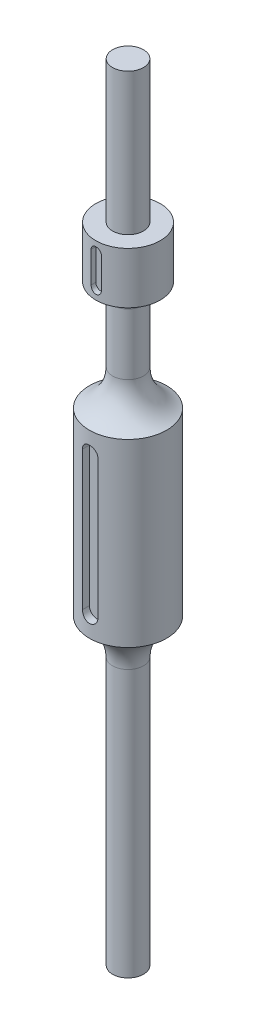
ISO-10303-21;
HEADER;
FILE_DESCRIPTION(('STEP AP214'),'2;1');
FILE_NAME('part.step','',(''),(''),'','','');
FILE_SCHEMA(('AUTOMOTIVE_DESIGN { 1 0 10303 214 1 1 1 1 }'));
ENDSEC;
DATA;
#1=APPLICATION_CONTEXT('core data for automotive mechanical design processes');
#2=APPLICATION_PROTOCOL_DEFINITION('international standard','automotive_design',2000,#1);
#3=PRODUCT_CONTEXT('',#1,'mechanical');
#4=PRODUCT('Part','Part','',(#3));
#5=PRODUCT_RELATED_PRODUCT_CATEGORY('part','',(#4));
#6=PRODUCT_DEFINITION_FORMATION('','',#4);
#7=PRODUCT_DEFINITION_CONTEXT('part definition',#1,'design');
#8=PRODUCT_DEFINITION('design','',#6,#7);
#9=PRODUCT_DEFINITION_SHAPE('','',#8);
#10=(LENGTH_UNIT() NAMED_UNIT(*) SI_UNIT(.MILLI.,.METRE.));
#11=(NAMED_UNIT(*) PLANE_ANGLE_UNIT() SI_UNIT($,.RADIAN.));
#12=(NAMED_UNIT(*) SI_UNIT($,.STERADIAN.) SOLID_ANGLE_UNIT());
#13=UNCERTAINTY_MEASURE_WITH_UNIT(LENGTH_MEASURE(1.E-05),#10,'distance_accuracy_value','');
#14=(GEOMETRIC_REPRESENTATION_CONTEXT(3) GLOBAL_UNCERTAINTY_ASSIGNED_CONTEXT((#13)) GLOBAL_UNIT_ASSIGNED_CONTEXT((#10,
#11,#12)) REPRESENTATION_CONTEXT('',''));
#15=CARTESIAN_POINT('',(0.,0.,0.));
#16=DIRECTION('',(0.,0.,1.));
#17=DIRECTION('',(1.,0.,0.));
#18=AXIS2_PLACEMENT_3D('',#15,#16,#17);
#19=CARTESIAN_POINT('',(0.,246.,10.5));
#20=DIRECTION('',(0.,0.,-1.));
#21=DIRECTION('',(0.,-1.,0.));
#22=AXIS2_PLACEMENT_3D('',#19,#20,#21);
#23=PLANE('',#22);
#24=CARTESIAN_POINT('',(0.,246.,10.5));
#25=DIRECTION('',(0.,0.,1.));
#26=DIRECTION('',(-1.,0.,0.));
#27=AXIS2_PLACEMENT_3D('',#24,#25,#26);
#28=CIRCLE('',#27,2.);
#29=CARTESIAN_POINT('',(2.,246.,10.5));
#30=VERTEX_POINT('',#29);
#31=CARTESIAN_POINT('',(-2.,246.,10.5));
#32=VERTEX_POINT('',#31);
#33=EDGE_CURVE('E142',#30,#32,#28,.T.);
#34=ORIENTED_EDGE('',*,*,#33,.T.);
#35=DIRECTION('',(0.,-1.,0.));
#36=VECTOR('',#35,1.);
#37=CARTESIAN_POINT('',(-2.,246.,10.5));
#38=LINE('',#37,#36);
#39=CARTESIAN_POINT('',(-2.,234.,10.5));
#40=VERTEX_POINT('',#39);
#41=EDGE_CURVE('E10',#32,#40,#38,.T.);
#42=ORIENTED_EDGE('',*,*,#41,.T.);
#43=CARTESIAN_POINT('',(0.,234.,10.5));
#44=DIRECTION('',(0.,0.,1.));
#45=DIRECTION('',(1.,0.,0.));
#46=AXIS2_PLACEMENT_3D('',#43,#44,#45);
#47=CIRCLE('',#46,2.);
#48=CARTESIAN_POINT('',(2.,234.,10.5));
#49=VERTEX_POINT('',#48);
#50=EDGE_CURVE('E33',#40,#49,#47,.T.);
#51=ORIENTED_EDGE('',*,*,#50,.T.);
#52=DIRECTION('',(0.,1.,0.));
#53=VECTOR('',#52,1.);
#54=CARTESIAN_POINT('',(2.,246.,10.5));
#55=LINE('',#54,#53);
#56=EDGE_CURVE('E137',#49,#30,#55,.T.);
#57=ORIENTED_EDGE('',*,*,#56,.T.);
#58=EDGE_LOOP('',(#34,#42,#51,#57));
#59=FACE_BOUND('',#58,.T.);
#60=ADVANCED_FACE('F15',(#59),#23,.F.);
#61=CARTESIAN_POINT('',(-2.,246.,10.5));
#62=DIRECTION('',(-1.,0.,0.));
#63=DIRECTION('',(0.,1.,0.));
#64=AXIS2_PLACEMENT_3D('',#61,#62,#63);
#65=PLANE('',#64);
#66=DIRECTION('',(0.,-1.,0.));
#67=VECTOR('',#66,1.);
#68=CARTESIAN_POINT('',(-1.99999999999996,0.,12.3389626792531));
#69=LINE('',#68,#67);
#70=CARTESIAN_POINT('',(-1.99999999999999,246.,12.3389626792531));
#71=VERTEX_POINT('',#70);
#72=CARTESIAN_POINT('',(-1.99999999999998,234.,12.3389626792531));
#73=VERTEX_POINT('',#72);
#74=EDGE_CURVE('E165',#71,#73,#69,.T.);
#75=ORIENTED_EDGE('',*,*,#74,.T.);
#76=DIRECTION('',(0.,0.,1.));
#77=VECTOR('',#76,1.);
#78=CARTESIAN_POINT('',(-2.,234.,10.5));
#79=LINE('',#78,#77);
#80=EDGE_CURVE('E179',#40,#73,#79,.T.);
#81=ORIENTED_EDGE('',*,*,#80,.F.);
#82=ORIENTED_EDGE('',*,*,#41,.F.);
#83=DIRECTION('',(0.,0.,1.));
#84=VECTOR('',#83,1.);
#85=CARTESIAN_POINT('',(-2.,246.,10.5));
#86=LINE('',#85,#84);
#87=EDGE_CURVE('E145',#32,#71,#86,.T.);
#88=ORIENTED_EDGE('',*,*,#87,.T.);
#89=EDGE_LOOP('',(#75,#81,#82,#88));
#90=FACE_BOUND('',#89,.T.);
#91=ADVANCED_FACE('F235',(#90),#65,.F.);
#92=CARTESIAN_POINT('',(0.,234.,10.5));
#93=DIRECTION('',(0.,0.,1.));
#94=DIRECTION('',(1.,0.,0.));
#95=AXIS2_PLACEMENT_3D('',#92,#93,#94);
#96=CYLINDRICAL_SURFACE('',#95,2.);
#97=ORIENTED_EDGE('',*,*,#80,.T.);
#98=CARTESIAN_POINT('',(-2.,234.,12.3389626792531));
#99=CARTESIAN_POINT('',(-2.00000005409011,233.944115853252,12.3389604499152));
#100=CARTESIAN_POINT('',(-1.99765624152515,233.888258836602,12.3393428185492));
#101=CARTESIAN_POINT('',(-1.98830863170739,233.776951634252,12.3408533726476));
#102=CARTESIAN_POINT('',(-1.98130528142227,233.721501410046,12.3419814865761));
#103=CARTESIAN_POINT('',(-1.95338622500057,233.556506194299,12.3464432069435));
#104=CARTESIAN_POINT('',(-1.92556123974497,233.448077708837,12.3508543861374));
#105=CARTESIAN_POINT('',(-1.85231034189502,233.237507469593,12.36205087212));
#106=CARTESIAN_POINT('',(-1.80687990806664,233.13536733853,12.3688367887186));
#107=CARTESIAN_POINT('',(-1.69973547147856,232.94014608565,12.3840145335208));
#108=CARTESIAN_POINT('',(-1.63802218252368,232.847064566968,12.3924062913233));
#109=CARTESIAN_POINT('',(-1.49948243336649,232.671793435099,12.4099336158774));
#110=CARTESIAN_POINT('',(-1.42253988223155,232.589696156941,12.4190745586902));
#111=CARTESIAN_POINT('',(-1.25594442259563,232.43949219829,12.4370257352146));
#112=CARTESIAN_POINT('',(-1.16628682347945,232.371390703689,12.4458358453572));
#113=CARTESIAN_POINT('',(-0.976189408262806,232.250770330128,12.4621908895486));
#114=CARTESIAN_POINT('',(-0.875689155854533,232.198345661838,12.4697280605143));
#115=CARTESIAN_POINT('',(-0.667243240189951,232.111212674504,12.4826137080213));
#116=CARTESIAN_POINT('',(-0.559306503800811,232.076483520083,12.4879647571074));
#117=CARTESIAN_POINT('',(-0.375660451654736,232.03414299093,12.4945719725761));
#118=CARTESIAN_POINT('',(-0.301130278846233,232.02135842045,12.4965975693532));
#119=CARTESIAN_POINT('',(-0.151077434578618,232.00428525633,12.49931225974));
#120=CARTESIAN_POINT('',(-0.075554754859862,231.99999673344,12.5000013422201));
#121=CARTESIAN_POINT('',(0.111567668911201,232.000004823555,12.4999980180153));
#122=CARTESIAN_POINT('',(0.223205277188554,232.009367829911,12.498490575283));
#123=CARTESIAN_POINT('',(0.443360136386998,232.04656186271,12.4926216572517));
#124=CARTESIAN_POINT('',(0.551874046641782,232.074411946771,12.4882572368687));
#125=CARTESIAN_POINT('',(0.762553612400641,232.14772093747,12.4771644485808));
#126=CARTESIAN_POINT('',(0.864724493558558,232.193165119835,12.4704380578148));
#127=CARTESIAN_POINT('',(1.05997618784631,232.300337013858,12.4553623763612));
#128=CARTESIAN_POINT('',(1.1530581547703,232.36206265497,12.4470132920701));
#129=CARTESIAN_POINT('',(1.32832567777817,232.500623997212,12.4295366083308));
#130=CARTESIAN_POINT('',(1.4104194499096,232.577575093282,12.4204033852715));
#131=CARTESIAN_POINT('',(1.56059147308182,232.744161645693,12.402430741773));
#132=CARTESIAN_POINT('',(1.62866830969597,232.833798380583,12.3935913510595));
#133=CARTESIAN_POINT('',(1.74924752139008,233.023846579792,12.3771511676222));
#134=CARTESIAN_POINT('',(1.80165569363188,233.124318461391,12.3695579857145));
#135=CARTESIAN_POINT('',(1.88879268730625,233.332765219477,12.3565535308975));
#136=CARTESIAN_POINT('',(1.92353210107235,233.440735556444,12.3511409511336));
#137=CARTESIAN_POINT('',(1.96587849164216,233.62444994162,12.3444569703058));
#138=CARTESIAN_POINT('',(1.97866210160406,233.699013602877,12.3424075929769));
#139=CARTESIAN_POINT('',(1.99572395692232,233.849040115375,12.3396558456616));
#140=CARTESIAN_POINT('',(2.00001247904484,233.924501768918,12.3389518481647));
#141=CARTESIAN_POINT('',(2.,234.,12.3389626792531));
#142=B_SPLINE_CURVE_WITH_KNOTS('',3,(#98,#99,#100,#101,#102,#103,#104,#105,#106,#107,#108,#109,
#110,#111,#112,#113,#114,#115,#116,#117,#118,#119,#120,#121,#122,#123,#124,#125,#126,#127,#128,
#129,#130,#131,#132,#133,#134,#135,#136,#137,#138,#139,#140,#141),.UNSPECIFIED.,.F.,.F.,(4,2,2,
2,2,2,2,2,2,2,2,2,2,2,2,2,2,2,2,2,2,4),(0.,0.167548319519549,0.335080569228728,
0.669437433390859,1.00388022029958,1.33830834840196,1.67539143312505,2.0125991937392,
2.35179447622135,2.69058944885092,2.91706422426957,3.14354088560695,3.47796686865816,
3.81273813509633,4.14722983931368,4.48167902605537,4.81876746919201,5.15588991073426,
5.49500021702126,5.83390698801854,6.0604808183102,6.28678038755017),.UNSPECIFIED.);
#143=CARTESIAN_POINT('',(2.00000000000001,234.,12.3389626792531));
#144=VERTEX_POINT('',#143);
#145=EDGE_CURVE('E160',#73,#144,#142,.T.);
#146=ORIENTED_EDGE('',*,*,#145,.T.);
#147=DIRECTION('',(0.,0.,1.));
#148=VECTOR('',#147,1.);
#149=CARTESIAN_POINT('',(2.,234.,10.5));
#150=LINE('',#149,#148);
#151=EDGE_CURVE('E141',#49,#144,#150,.T.);
#152=ORIENTED_EDGE('',*,*,#151,.F.);
#153=ORIENTED_EDGE('',*,*,#50,.F.);
#154=EDGE_LOOP('',(#97,#146,#152,#153));
#155=FACE_BOUND('',#154,.T.);
#156=ADVANCED_FACE('F17',(#155),#96,.F.);
#157=CARTESIAN_POINT('',(2.,246.,10.5));
#158=DIRECTION('',(1.,0.,0.));
#159=DIRECTION('',(0.,1.,0.));
#160=AXIS2_PLACEMENT_3D('',#157,#158,#159);
#161=PLANE('',#160);
#162=DIRECTION('',(0.,1.,0.));
#163=VECTOR('',#162,1.);
#164=CARTESIAN_POINT('',(2.00000000000004,0.,12.3389626792531));
#165=LINE('',#164,#163);
#166=CARTESIAN_POINT('',(2.00000000000002,246.,12.3389626792531));
#167=VERTEX_POINT('',#166);
#168=EDGE_CURVE('E199',#144,#167,#165,.T.);
#169=ORIENTED_EDGE('',*,*,#168,.T.);
#170=DIRECTION('',(0.,0.,1.));
#171=VECTOR('',#170,1.);
#172=CARTESIAN_POINT('',(2.,246.,10.5));
#173=LINE('',#172,#171);
#174=EDGE_CURVE('E177',#30,#167,#173,.T.);
#175=ORIENTED_EDGE('',*,*,#174,.F.);
#176=ORIENTED_EDGE('',*,*,#56,.F.);
#177=ORIENTED_EDGE('',*,*,#151,.T.);
#178=EDGE_LOOP('',(#169,#175,#176,#177));
#179=FACE_BOUND('',#178,.T.);
#180=ADVANCED_FACE('F511',(#179),#161,.F.);
#181=CARTESIAN_POINT('',(0.,246.,10.5));
#182=DIRECTION('',(0.,0.,1.));
#183=DIRECTION('',(1.,0.,0.));
#184=AXIS2_PLACEMENT_3D('',#181,#182,#183);
#185=CYLINDRICAL_SURFACE('',#184,2.);
#186=ORIENTED_EDGE('',*,*,#174,.T.);
#187=CARTESIAN_POINT('',(2.,246.,12.3389626792531));
#188=CARTESIAN_POINT('',(2.00000005409011,246.055884146748,12.3389604499152));
#189=CARTESIAN_POINT('',(1.99765624152515,246.111741163398,12.3393428185492));
#190=CARTESIAN_POINT('',(1.9883086317074,246.223048365748,12.3408533726476));
#191=CARTESIAN_POINT('',(1.98130528142227,246.278498589954,12.3419814865761));
#192=CARTESIAN_POINT('',(1.95338622500057,246.443493805701,12.3464432069435));
#193=CARTESIAN_POINT('',(1.92556123974497,246.551922291163,12.3508543861374));
#194=CARTESIAN_POINT('',(1.85231034189502,246.762492530407,12.36205087212));
#195=CARTESIAN_POINT('',(1.80687990806663,246.86463266147,12.3688367887186));
#196=CARTESIAN_POINT('',(1.69973547147855,247.05985391435,12.3840145335208));
#197=CARTESIAN_POINT('',(1.63802218252367,247.152935433032,12.3924062913233));
#198=CARTESIAN_POINT('',(1.4994824333665,247.328206564901,12.4099336158774));
#199=CARTESIAN_POINT('',(1.42253988223155,247.410303843059,12.4190745586902));
#200=CARTESIAN_POINT('',(1.25594442259563,247.56050780171,12.4370257352146));
#201=CARTESIAN_POINT('',(1.16628682347945,247.628609296311,12.4458358453572));
#202=CARTESIAN_POINT('',(0.976189408262804,247.749229669872,12.4621908895486));
#203=CARTESIAN_POINT('',(0.875689155854528,247.801654338162,12.4697280605143));
#204=CARTESIAN_POINT('',(0.667243240189946,247.888787325496,12.4826137080213));
#205=CARTESIAN_POINT('',(0.559306503800809,247.923516479918,12.4879647571074));
#206=CARTESIAN_POINT('',(0.375660451654739,247.96585700907,12.4945719725761));
#207=CARTESIAN_POINT('',(0.301130278846237,247.97864157955,12.4965975693532));
#208=CARTESIAN_POINT('',(0.151077434578624,247.99571474367,12.49931225974));
#209=CARTESIAN_POINT('',(0.0755547548598665,248.00000326656,12.5000013422201));
#210=CARTESIAN_POINT('',(-0.111567668911198,247.999995176445,12.4999980180153));
#211=CARTESIAN_POINT('',(-0.22320527718855,247.990632170089,12.498490575283));
#212=CARTESIAN_POINT('',(-0.443360136386995,247.95343813729,12.4926216572517));
#213=CARTESIAN_POINT('',(-0.55187404664178,247.925588053229,12.4882572368687));
#214=CARTESIAN_POINT('',(-0.762553612400634,247.85227906253,12.4771644485808));
#215=CARTESIAN_POINT('',(-0.864724493558546,247.806834880165,12.4704380578149));
#216=CARTESIAN_POINT('',(-1.0599761878463,247.699662986142,12.4553623763612));
#217=CARTESIAN_POINT('',(-1.15305815477029,247.63793734503,12.4470132920701));
#218=CARTESIAN_POINT('',(-1.32832567777817,247.499376002788,12.4295366083308));
#219=CARTESIAN_POINT('',(-1.4104194499096,247.422424906718,12.4204033852715));
#220=CARTESIAN_POINT('',(-1.56059147308182,247.255838354307,12.402430741773));
#221=CARTESIAN_POINT('',(-1.62866830969596,247.166201619417,12.3935913510595));
#222=CARTESIAN_POINT('',(-1.74924752139007,246.976153420208,12.3771511676222));
#223=CARTESIAN_POINT('',(-1.80165569363187,246.875681538609,12.3695579857145));
#224=CARTESIAN_POINT('',(-1.88879268730624,246.667234780523,12.3565535308975));
#225=CARTESIAN_POINT('',(-1.92353210107234,246.559264443556,12.3511409511336));
#226=CARTESIAN_POINT('',(-1.96587849164216,246.37555005838,12.3444569703058));
#227=CARTESIAN_POINT('',(-1.97866210160406,246.300986397123,12.3424075929769));
#228=CARTESIAN_POINT('',(-1.99572395692232,246.150959884625,12.3396558456616));
#229=CARTESIAN_POINT('',(-2.00001247904484,246.075498231082,12.3389518481647));
#230=CARTESIAN_POINT('',(-2.,246.,12.3389626792531));
#231=B_SPLINE_CURVE_WITH_KNOTS('',3,(#187,#188,#189,#190,#191,#192,#193,#194,#195,#196,#197,
#198,#199,#200,#201,#202,#203,#204,#205,#206,#207,#208,#209,#210,#211,#212,#213,#214,#215,#216,
#217,#218,#219,#220,#221,#222,#223,#224,#225,#226,#227,#228,#229,#230),.UNSPECIFIED.,.F.,.F.,(4,
2,2,2,2,2,2,2,2,2,2,2,2,2,2,2,2,2,2,2,2,4),(0.,0.167548319519522,0.335080569228728,
0.669437433390859,1.00388022029961,1.33830834840196,1.67539143312505,2.0125991937392,
2.35179447622136,2.69058944885092,2.91706422426956,3.14354088560695,3.47796686865815,
3.81273813509632,4.14722983931367,4.48167902605537,4.81876746919201,5.15588991073426,
5.49500021702123,5.83390698801854,6.0604808183102,6.28678038755017),.UNSPECIFIED.);
#232=EDGE_CURVE('E150',#167,#71,#231,.T.);
#233=ORIENTED_EDGE('',*,*,#232,.T.);
#234=ORIENTED_EDGE('',*,*,#87,.F.);
#235=ORIENTED_EDGE('',*,*,#33,.F.);
#236=EDGE_LOOP('',(#186,#233,#234,#235));
#237=FACE_BOUND('',#236,.T.);
#238=ADVANCED_FACE('F503',(#237),#185,.F.);
#239=CARTESIAN_POINT('',(0.,179.5,12.));
#240=DIRECTION('',(0.,0.,1.));
#241=DIRECTION('',(1.,0.,0.));
#242=AXIS2_PLACEMENT_3D('',#239,#240,#241);
#243=PLANE('',#242);
#244=CARTESIAN_POINT('',(0.,179.5,12.));
#245=DIRECTION('',(0.,0.,1.));
#246=DIRECTION('',(1.,0.,0.));
#247=AXIS2_PLACEMENT_3D('',#244,#245,#246);
#248=CIRCLE('',#247,3.);
#249=CARTESIAN_POINT('',(3.,179.5,12.));
#250=VERTEX_POINT('',#249);
#251=CARTESIAN_POINT('',(-3.,179.5,12.));
#252=VERTEX_POINT('',#251);
#253=EDGE_CURVE('E101',#250,#252,#248,.T.);
#254=ORIENTED_EDGE('',*,*,#253,.T.);
#255=DIRECTION('',(0.,-1.,0.));
#256=VECTOR('',#255,1.);
#257=CARTESIAN_POINT('',(-3.,179.5,12.));
#258=LINE('',#257,#256);
#259=CARTESIAN_POINT('',(-3.,125.5,12.));
#260=VERTEX_POINT('',#259);
#261=EDGE_CURVE('E172',#252,#260,#258,.T.);
#262=ORIENTED_EDGE('',*,*,#261,.T.);
#263=CARTESIAN_POINT('',(0.,125.5,12.));
#264=DIRECTION('',(0.,0.,1.));
#265=DIRECTION('',(1.,0.,0.));
#266=AXIS2_PLACEMENT_3D('',#263,#264,#265);
#267=CIRCLE('',#266,3.);
#268=CARTESIAN_POINT('',(3.,125.5,12.));
#269=VERTEX_POINT('',#268);
#270=EDGE_CURVE('E168',#260,#269,#267,.T.);
#271=ORIENTED_EDGE('',*,*,#270,.T.);
#272=DIRECTION('',(0.,1.,0.));
#273=VECTOR('',#272,1.);
#274=CARTESIAN_POINT('',(3.,179.5,12.));
#275=LINE('',#274,#273);
#276=EDGE_CURVE('E151',#269,#250,#275,.T.);
#277=ORIENTED_EDGE('',*,*,#276,.T.);
#278=EDGE_LOOP('',(#254,#262,#271,#277));
#279=FACE_BOUND('',#278,.T.);
#280=ADVANCED_FACE('F495',(#279),#243,.T.);
#281=CARTESIAN_POINT('',(-3.,179.5,12.));
#282=DIRECTION('',(-1.,0.,0.));
#283=DIRECTION('',(0.,1.,0.));
#284=AXIS2_PLACEMENT_3D('',#281,#282,#283);
#285=PLANE('',#284);
#286=DIRECTION('',(0.,-1.,0.));
#287=VECTOR('',#286,1.);
#288=CARTESIAN_POINT('',(-3.,0.,14.6969384566991));
#289=LINE('',#288,#287);
#290=CARTESIAN_POINT('',(-3.,179.5,14.6969384566991));
#291=VERTEX_POINT('',#290);
#292=CARTESIAN_POINT('',(-3.,125.5,14.6969384566991));
#293=VERTEX_POINT('',#292);
#294=EDGE_CURVE('E104',#291,#293,#289,.T.);
#295=ORIENTED_EDGE('',*,*,#294,.T.);
#296=DIRECTION('',(0.,0.,1.));
#297=VECTOR('',#296,1.);
#298=CARTESIAN_POINT('',(-3.,125.5,12.));
#299=LINE('',#298,#297);
#300=EDGE_CURVE('E173',#260,#293,#299,.T.);
#301=ORIENTED_EDGE('',*,*,#300,.F.);
#302=ORIENTED_EDGE('',*,*,#261,.F.);
#303=DIRECTION('',(0.,0.,1.));
#304=VECTOR('',#303,1.);
#305=CARTESIAN_POINT('',(-3.,179.5,12.));
#306=LINE('',#305,#304);
#307=EDGE_CURVE('E103',#252,#291,#306,.T.);
#308=ORIENTED_EDGE('',*,*,#307,.T.);
#309=EDGE_LOOP('',(#295,#301,#302,#308));
#310=FACE_BOUND('',#309,.T.);
#311=ADVANCED_FACE('F255',(#310),#285,.F.);
#312=CARTESIAN_POINT('',(0.,125.5,12.));
#313=DIRECTION('',(0.,0.,1.));
#314=DIRECTION('',(1.,0.,0.));
#315=AXIS2_PLACEMENT_3D('',#312,#313,#314);
#316=CYLINDRICAL_SURFACE('',#315,3.);
#317=ORIENTED_EDGE('',*,*,#300,.T.);
#318=CARTESIAN_POINT('',(-2.99999999999999,125.5,14.6969384566991));
#319=CARTESIAN_POINT('',(-3.00000906370815,125.416523339692,14.6969312245365));
#320=CARTESIAN_POINT('',(-2.99651592727123,125.333051686402,14.6976495031044));
#321=CARTESIAN_POINT('',(-2.9825955559087,125.166722489369,14.7004835308714));
#322=CARTESIAN_POINT('',(-2.97216917869553,125.083864870946,14.7025991072105));
#323=CARTESIAN_POINT('',(-2.94447360923162,124.919471627922,14.7081699774599));
#324=CARTESIAN_POINT('',(-2.92721481698046,124.837934189244,14.7116232350401));
#325=CARTESIAN_POINT('',(-2.88600729844733,124.676653868976,14.7197622002395));
#326=CARTESIAN_POINT('',(-2.86205854497703,124.596910994681,14.7244479128674));
#327=CARTESIAN_POINT('',(-2.78041424546198,124.36119126924,14.7401633027328));
#328=CARTESIAN_POINT('',(-2.71289905520327,124.20859606462,14.7528558552623));
#329=CARTESIAN_POINT('',(-2.55375202785479,123.916967229604,14.7812326927794));
#330=CARTESIAN_POINT('',(-2.4621186194595,123.777934483615,14.7969171726732));
#331=CARTESIAN_POINT('',(-2.2559545542959,123.515343329792,14.82975639316));
#332=CARTESIAN_POINT('',(-2.14115251118809,123.39199960476,14.8469270345405));
#333=CARTESIAN_POINT('',(-1.89245828826132,123.166155741838,14.8806693012787));
#334=CARTESIAN_POINT('',(-1.75855916529667,123.063663217871,14.8972407060123));
#335=CARTESIAN_POINT('',(-1.47401018587283,122.881586756659,14.9280924317196));
#336=CARTESIAN_POINT('',(-1.32321869254619,122.802220282874,14.9423504783955));
#337=CARTESIAN_POINT('',(-1.0102171721797,122.670115003565,14.9667631381291));
#338=CARTESIAN_POINT('',(-0.848020936057871,122.617344647467,14.9769226103942));
#339=CARTESIAN_POINT('',(-0.570814378644982,122.552567090162,14.9895543798401));
#340=CARTESIAN_POINT('',(-0.457602564459094,122.532885515968,14.9934519509649));
#341=CARTESIAN_POINT('',(-0.229609815567668,122.506599477362,14.9986760019705));
#342=CARTESIAN_POINT('',(-0.114828880700489,122.499995014298,15.0000024815864));
#343=CARTESIAN_POINT('',(0.166699845024659,122.500007237863,14.9999963974214));
#344=CARTESIAN_POINT('',(0.333500736020008,122.513943906507,14.9971920055894));
#345=CARTESIAN_POINT('',(0.662410566750313,122.569286640137,14.9862727846373));
#346=CARTESIAN_POINT('',(0.82451463968489,122.610720204527,14.9781526393894));
#347=CARTESIAN_POINT('',(1.1391919863605,122.719724580805,14.9575093091814));
#348=CARTESIAN_POINT('',(1.29177505887543,122.787267988059,14.9449907420122));
#349=CARTESIAN_POINT('',(1.58342780886357,122.946499158364,14.9169115494654));
#350=CARTESIAN_POINT('',(1.72249863607244,123.038184864717,14.9013511832497));
#351=CARTESIAN_POINT('',(1.98507752297592,123.244412984245,14.8686653127944));
#352=CARTESIAN_POINT('',(2.10837644827321,123.359219045142,14.8515231194846));
#353=CARTESIAN_POINT('',(2.33410611179454,123.607872735784,14.81772609096));
#354=CARTESIAN_POINT('',(2.43653433803202,123.74172265435,14.8010713146169));
#355=CARTESIAN_POINT('',(2.61852007291936,124.026183986968,14.7699690156844));
#356=CARTESIAN_POINT('',(2.69785463608387,124.176940505642,14.7555436021367));
#357=CARTESIAN_POINT('',(2.82994897852781,124.489952713478,14.7307818243809));
#358=CARTESIAN_POINT('',(2.88272613603271,124.65220080345,14.7204427871457));
#359=CARTESIAN_POINT('',(2.94748810118464,124.929476770936,14.7075840047695));
#360=CARTESIAN_POINT('',(2.96715712624722,125.042702147567,14.7036148318731));
#361=CARTESIAN_POINT('',(2.9934171741354,125.27059998096,14.6982822885476));
#362=CARTESIAN_POINT('',(3.00002166920517,125.385270824173,14.6969162338164));
#363=CARTESIAN_POINT('',(3.00000000000001,125.5,14.6969384566991));
#364=B_SPLINE_CURVE_WITH_KNOTS('',3,(#318,#319,#320,#321,#322,#323,#324,#325,#326,#327,#328,
#329,#330,#331,#332,#333,#334,#335,#336,#337,#338,#339,#340,#341,#342,#343,#344,#345,#346,#347,
#348,#349,#350,#351,#352,#353,#354,#355,#356,#357,#358,#359,#360,#361,#362,#363),.UNSPECIFIED.,
.F.,.F.,(4,2,2,2,2,2,2,2,2,2,2,2,2,2,2,2,2,2,2,2,2,2,4),(0.,0.250345086412884,0.50065920835117,
0.750593769258302,1.00052934592644,1.50001791001691,1.99953902392061,2.50529175272605,
3.01122882955846,3.52178030560669,4.03172468807532,4.37592005690799,4.72011546119772,
5.21979219934302,5.71996941439675,6.21962306759383,6.71923416874783,7.22490279742076,
7.73063225220449,8.24109333265689,8.75121994966905,9.09545373442176,9.43933235720269),.UNSPECIFIED.);
#365=CARTESIAN_POINT('',(3.,125.5,14.6969384566991));
#366=VERTEX_POINT('',#365);
#367=EDGE_CURVE('E111',#293,#366,#364,.T.);
#368=ORIENTED_EDGE('',*,*,#367,.T.);
#369=DIRECTION('',(0.,0.,1.));
#370=VECTOR('',#369,1.);
#371=CARTESIAN_POINT('',(3.,125.5,12.));
#372=LINE('',#371,#370);
#373=EDGE_CURVE('E86',#269,#366,#372,.T.);
#374=ORIENTED_EDGE('',*,*,#373,.F.);
#375=ORIENTED_EDGE('',*,*,#270,.F.);
#376=EDGE_LOOP('',(#317,#368,#374,#375));
#377=FACE_BOUND('',#376,.T.);
#378=ADVANCED_FACE('F251',(#377),#316,.F.);
#379=CARTESIAN_POINT('',(3.,179.5,12.));
#380=DIRECTION('',(1.,0.,0.));
#381=DIRECTION('',(0.,1.,0.));
#382=AXIS2_PLACEMENT_3D('',#379,#380,#381);
#383=PLANE('',#382);
#384=DIRECTION('',(0.,1.,0.));
#385=VECTOR('',#384,1.);
#386=CARTESIAN_POINT('',(3.,0.,14.6969384566991));
#387=LINE('',#386,#385);
#388=CARTESIAN_POINT('',(3.,179.5,14.6969384566991));
#389=VERTEX_POINT('',#388);
#390=EDGE_CURVE('E107',#366,#389,#387,.T.);
#391=ORIENTED_EDGE('',*,*,#390,.T.);
#392=DIRECTION('',(0.,0.,1.));
#393=VECTOR('',#392,1.);
#394=CARTESIAN_POINT('',(3.,179.5,12.));
#395=LINE('',#394,#393);
#396=EDGE_CURVE('E95',#250,#389,#395,.T.);
#397=ORIENTED_EDGE('',*,*,#396,.F.);
#398=ORIENTED_EDGE('',*,*,#276,.F.);
#399=ORIENTED_EDGE('',*,*,#373,.T.);
#400=EDGE_LOOP('',(#391,#397,#398,#399));
#401=FACE_BOUND('',#400,.T.);
#402=ADVANCED_FACE('F108',(#401),#383,.F.);
#403=CARTESIAN_POINT('',(0.,179.5,12.));
#404=DIRECTION('',(0.,0.,1.));
#405=DIRECTION('',(1.,0.,0.));
#406=AXIS2_PLACEMENT_3D('',#403,#404,#405);
#407=CYLINDRICAL_SURFACE('',#406,3.);
#408=ORIENTED_EDGE('',*,*,#396,.T.);
#409=CARTESIAN_POINT('',(3.,179.5,14.6969384566991));
#410=CARTESIAN_POINT('',(3.00000906370816,179.583476660308,14.6969312245365));
#411=CARTESIAN_POINT('',(2.99651592727124,179.666948313598,14.6976495031043));
#412=CARTESIAN_POINT('',(2.98259555590871,179.833277510631,14.7004835308714));
#413=CARTESIAN_POINT('',(2.97216917869554,179.916135129054,14.7025991072105));
#414=CARTESIAN_POINT('',(2.94447360923163,180.080528372078,14.7081699774599));
#415=CARTESIAN_POINT('',(2.92721481698047,180.162065810756,14.7116232350401));
#416=CARTESIAN_POINT('',(2.88600729844734,180.323346131024,14.7197622002395));
#417=CARTESIAN_POINT('',(2.86205854497704,180.403089005319,14.7244479128674));
#418=CARTESIAN_POINT('',(2.78041424546199,180.63880873076,14.7401633027328));
#419=CARTESIAN_POINT('',(2.71289905520329,180.79140393538,14.7528558552623));
#420=CARTESIAN_POINT('',(2.55375202785482,181.083032770396,14.7812326927794));
#421=CARTESIAN_POINT('',(2.46211861945951,181.222065516385,14.7969171726732));
#422=CARTESIAN_POINT('',(2.25595455429592,181.484656670208,14.82975639316));
#423=CARTESIAN_POINT('',(2.14115251118811,181.60800039524,14.8469270345405));
#424=CARTESIAN_POINT('',(1.89245828826134,181.833844258162,14.8806693012787));
#425=CARTESIAN_POINT('',(1.75855916529669,181.936336782129,14.8972407060123));
#426=CARTESIAN_POINT('',(1.47401018587284,182.118413243341,14.9280924317196));
#427=CARTESIAN_POINT('',(1.32321869254621,182.197779717126,14.9423504783955));
#428=CARTESIAN_POINT('',(1.01021717217971,182.329884996435,14.9667631381291));
#429=CARTESIAN_POINT('',(0.84802093605789,182.382655352533,14.9769226103942));
#430=CARTESIAN_POINT('',(0.570814378644997,182.447432909838,14.9895543798401));
#431=CARTESIAN_POINT('',(0.457602564459105,182.467114484032,14.9934519509649));
#432=CARTESIAN_POINT('',(0.229609815567675,182.493400522638,14.9986760019705));
#433=CARTESIAN_POINT('',(0.114828880700495,182.500004985702,15.0000024815864));
#434=CARTESIAN_POINT('',(-0.166699845024656,182.499992762137,14.9999963974214));
#435=CARTESIAN_POINT('',(-0.333500736020006,182.486056093493,14.9971920055894));
#436=CARTESIAN_POINT('',(-0.662410566750312,182.430713359863,14.9862727846373));
#437=CARTESIAN_POINT('',(-0.824514639684887,182.389279795473,14.9781526393894));
#438=CARTESIAN_POINT('',(-1.1391919863605,182.280275419195,14.9575093091814));
#439=CARTESIAN_POINT('',(-1.29177505887543,182.212732011941,14.9449907420122));
#440=CARTESIAN_POINT('',(-1.58342780886356,182.053500841636,14.9169115494654));
#441=CARTESIAN_POINT('',(-1.72249863607244,181.961815135283,14.9013511832497));
#442=CARTESIAN_POINT('',(-1.98507752297592,181.755587015755,14.8686653127944));
#443=CARTESIAN_POINT('',(-2.10837644827321,181.640780954858,14.8515231194846));
#444=CARTESIAN_POINT('',(-2.33410611179453,181.392127264216,14.81772609096));
#445=CARTESIAN_POINT('',(-2.43653433803201,181.258277345649,14.8010713146169));
#446=CARTESIAN_POINT('',(-2.61852007291935,180.973816013032,14.7699690156844));
#447=CARTESIAN_POINT('',(-2.69785463608385,180.823059494358,14.7555436021367));
#448=CARTESIAN_POINT('',(-2.8299489785278,180.510047286522,14.7307818243809));
#449=CARTESIAN_POINT('',(-2.8827261360327,180.34779919655,14.7204427871457));
#450=CARTESIAN_POINT('',(-2.94748810118464,180.070523229064,14.7075840047695));
#451=CARTESIAN_POINT('',(-2.96715712624721,179.957297852433,14.7036148318731));
#452=CARTESIAN_POINT('',(-2.99341717413538,179.72940001904,14.6982822885476));
#453=CARTESIAN_POINT('',(-3.00002166920516,179.614729175827,14.6969162338164));
#454=CARTESIAN_POINT('',(-3.,179.5,14.6969384566991));
#455=B_SPLINE_CURVE_WITH_KNOTS('',3,(#409,#410,#411,#412,#413,#414,#415,#416,#417,#418,#419,
#420,#421,#422,#423,#424,#425,#426,#427,#428,#429,#430,#431,#432,#433,#434,#435,#436,#437,#438,
#439,#440,#441,#442,#443,#444,#445,#446,#447,#448,#449,#450,#451,#452,#453,#454),.UNSPECIFIED.,
.F.,.F.,(4,2,2,2,2,2,2,2,2,2,2,2,2,2,2,2,2,2,2,2,2,2,4),(0.,0.250345086412884,0.500659208351198,
0.750593769258316,1.00052934592644,1.50001791001689,1.99953902392058,2.50529175272605,
3.01122882955844,3.52178030560668,4.03172468807532,4.37592005690799,4.72011546119773,
5.21979219934303,5.71996941439676,6.21962306759384,6.71923416874784,7.22490279742077,
7.73063225220452,8.24109333265687,8.75121994966906,9.09545373442177,9.4393323572027),.UNSPECIFIED.);
#456=EDGE_CURVE('E20',#389,#291,#455,.T.);
#457=ORIENTED_EDGE('',*,*,#456,.T.);
#458=ORIENTED_EDGE('',*,*,#307,.F.);
#459=ORIENTED_EDGE('',*,*,#253,.F.);
#460=EDGE_LOOP('',(#408,#457,#458,#459));
#461=FACE_BOUND('',#460,.T.);
#462=ADVANCED_FACE('F96',(#461),#407,.F.);
#463=CARTESIAN_POINT('',(6.,0.,0.));
#464=DIRECTION('',(0.,-1.,0.));
#465=DIRECTION('',(0.,0.,-1.));
#466=AXIS2_PLACEMENT_3D('',#463,#464,#465);
#467=PLANE('',#466);
#468=CARTESIAN_POINT('',(0.,0.,0.));
#469=DIRECTION('',(0.,-1.,0.));
#470=DIRECTION('',(0.,0.,-1.));
#471=AXIS2_PLACEMENT_3D('',#468,#469,#470);
#472=CIRCLE('',#471,6.);
#473=CARTESIAN_POINT('',(0.,0.,-6.));
#474=VERTEX_POINT('',#473);
#475=EDGE_CURVE('E118',#474,#474,#472,.T.);
#476=ORIENTED_EDGE('',*,*,#475,.T.);
#477=EDGE_LOOP('',(#476));
#478=FACE_BOUND('',#477,.T.);
#479=ADVANCED_FACE('F244',(#478),#467,.T.);
#480=CARTESIAN_POINT('',(12.5,230.,0.));
#481=DIRECTION('',(0.,-1.,0.));
#482=DIRECTION('',(0.,0.,-1.));
#483=AXIS2_PLACEMENT_3D('',#480,#481,#482);
#484=PLANE('',#483);
#485=CARTESIAN_POINT('',(0.,230.,0.));
#486=DIRECTION('',(0.,1.,0.));
#487=DIRECTION('',(0.,0.,-1.));
#488=AXIS2_PLACEMENT_3D('',#485,#486,#487);
#489=CIRCLE('',#488,11.);
#490=CARTESIAN_POINT('',(0.,230.,-11.));
#491=VERTEX_POINT('',#490);
#492=EDGE_CURVE('E290',#491,#491,#489,.T.);
#493=ORIENTED_EDGE('',*,*,#492,.T.);
#494=EDGE_LOOP('',(#493));
#495=FACE_BOUND('',#494,.T.);
#496=CARTESIAN_POINT('',(0.,230.,0.));
#497=DIRECTION('',(0.,-1.,0.));
#498=DIRECTION('',(0.,0.,-1.));
#499=AXIS2_PLACEMENT_3D('',#496,#497,#498);
#500=CIRCLE('',#499,12.5);
#501=CARTESIAN_POINT('',(0.,230.,-12.5));
#502=VERTEX_POINT('',#501);
#503=EDGE_CURVE('E155',#502,#502,#500,.T.);
#504=ORIENTED_EDGE('',*,*,#503,.T.);
#505=EDGE_LOOP('',(#504));
#506=FACE_BOUND('',#505,.T.);
#507=ADVANCED_FACE('F242',(#495,#506),#484,.T.);
#508=CARTESIAN_POINT('',(6.,250.,0.));
#509=DIRECTION('',(0.,1.,0.));
#510=DIRECTION('',(1.,0.,0.));
#511=AXIS2_PLACEMENT_3D('',#508,#509,#510);
#512=PLANE('',#511);
#513=CARTESIAN_POINT('',(0.,250.,0.));
#514=DIRECTION('',(0.,-1.,0.));
#515=DIRECTION('',(0.,0.,-1.));
#516=AXIS2_PLACEMENT_3D('',#513,#514,#515);
#517=CIRCLE('',#516,6.);
#518=CARTESIAN_POINT('',(0.,250.,-6.));
#519=VERTEX_POINT('',#518);
#520=EDGE_CURVE('E161',#519,#519,#517,.T.);
#521=ORIENTED_EDGE('',*,*,#520,.T.);
#522=EDGE_LOOP('',(#521));
#523=FACE_BOUND('',#522,.T.);
#524=CARTESIAN_POINT('',(0.,250.,0.));
#525=DIRECTION('',(0.,-1.,0.));
#526=DIRECTION('',(0.,0.,-1.));
#527=AXIS2_PLACEMENT_3D('',#524,#525,#526);
#528=CIRCLE('',#527,12.5);
#529=CARTESIAN_POINT('',(0.,250.,-12.5));
#530=VERTEX_POINT('',#529);
#531=EDGE_CURVE('E146',#530,#530,#528,.T.);
#532=ORIENTED_EDGE('',*,*,#531,.F.);
#533=EDGE_LOOP('',(#532));
#534=FACE_BOUND('',#533,.T.);
#535=ADVANCED_FACE('F238',(#523,#534),#512,.T.);
#536=CARTESIAN_POINT('',(0.,305.,0.));
#537=DIRECTION('',(0.,1.,0.));
#538=DIRECTION('',(1.,0.,0.));
#539=AXIS2_PLACEMENT_3D('',#536,#537,#538);
#540=PLANE('',#539);
#541=CARTESIAN_POINT('',(0.,305.,0.));
#542=DIRECTION('',(0.,-1.,0.));
#543=DIRECTION('',(0.,0.,-1.));
#544=AXIS2_PLACEMENT_3D('',#541,#542,#543);
#545=CIRCLE('',#544,6.);
#546=CARTESIAN_POINT('',(0.,305.,-6.));
#547=VERTEX_POINT('',#546);
#548=EDGE_CURVE('E159',#547,#547,#545,.T.);
#549=ORIENTED_EDGE('',*,*,#548,.F.);
#550=EDGE_LOOP('',(#549));
#551=FACE_BOUND('',#550,.T.);
#552=ADVANCED_FACE('F231',(#551),#540,.T.);
#553=CARTESIAN_POINT('',(0.,0.,0.));
#554=DIRECTION('',(0.,-1.,0.));
#555=DIRECTION('',(0.,0.,-1.));
#556=AXIS2_PLACEMENT_3D('',#553,#554,#555);
#557=CYLINDRICAL_SURFACE('',#556,6.);
#558=ORIENTED_EDGE('',*,*,#520,.F.);
#559=EDGE_LOOP('',(#558));
#560=FACE_BOUND('',#559,.T.);
#561=ORIENTED_EDGE('',*,*,#548,.T.);
#562=EDGE_LOOP('',(#561));
#563=FACE_BOUND('',#562,.T.);
#564=ADVANCED_FACE('F226',(#560,#563),#557,.T.);
#565=CARTESIAN_POINT('',(0.,0.,0.));
#566=DIRECTION('',(0.,-1.,0.));
#567=DIRECTION('',(0.,0.,-1.));
#568=AXIS2_PLACEMENT_3D('',#565,#566,#567);
#569=CYLINDRICAL_SURFACE('',#568,12.5);
#570=ORIENTED_EDGE('',*,*,#74,.F.);
#571=ORIENTED_EDGE('',*,*,#232,.F.);
#572=ORIENTED_EDGE('',*,*,#168,.F.);
#573=ORIENTED_EDGE('',*,*,#145,.F.);
#574=EDGE_LOOP('',(#570,#571,#572,#573));
#575=FACE_BOUND('',#574,.T.);
#576=ORIENTED_EDGE('',*,*,#503,.F.);
#577=EDGE_LOOP('',(#576));
#578=FACE_BOUND('',#577,.T.);
#579=ORIENTED_EDGE('',*,*,#531,.T.);
#580=EDGE_LOOP('',(#579));
#581=FACE_BOUND('',#580,.T.);
#582=ADVANCED_FACE('F220',(#575,#578,#581),#569,.T.);
#583=CARTESIAN_POINT('',(0.,0.,0.));
#584=DIRECTION('',(0.,-1.,0.));
#585=DIRECTION('',(0.,0.,-1.));
#586=AXIS2_PLACEMENT_3D('',#583,#584,#585);
#587=CYLINDRICAL_SURFACE('',#586,6.);
#588=CARTESIAN_POINT('',(0.,201.247727084867,0.));
#589=DIRECTION('',(0.,1.,0.));
#590=DIRECTION('',(0.,0.,-1.));
#591=AXIS2_PLACEMENT_3D('',#588,#589,#590);
#592=CIRCLE('',#591,6.);
#593=CARTESIAN_POINT('',(0.,201.247727084867,-6.));
#594=VERTEX_POINT('',#593);
#595=EDGE_CURVE('E306',#594,#594,#592,.T.);
#596=ORIENTED_EDGE('',*,*,#595,.T.);
#597=EDGE_LOOP('',(#596));
#598=FACE_BOUND('',#597,.T.);
#599=CARTESIAN_POINT('',(0.,225.,0.));
#600=DIRECTION('',(0.,-1.,0.));
#601=DIRECTION('',(0.,0.,-1.));
#602=AXIS2_PLACEMENT_3D('',#599,#600,#601);
#603=CIRCLE('',#602,6.);
#604=CARTESIAN_POINT('',(0.,225.,-6.));
#605=VERTEX_POINT('',#604);
#606=EDGE_CURVE('E293',#605,#605,#603,.T.);
#607=ORIENTED_EDGE('',*,*,#606,.T.);
#608=EDGE_LOOP('',(#607));
#609=FACE_BOUND('',#608,.T.);
#610=ADVANCED_FACE('F225',(#598,#609),#587,.T.);
#611=CARTESIAN_POINT('',(0.,0.,0.));
#612=DIRECTION('',(0.,-1.,0.));
#613=DIRECTION('',(0.,0.,-1.));
#614=AXIS2_PLACEMENT_3D('',#611,#612,#613);
#615=CYLINDRICAL_SURFACE('',#614,15.);
#616=ORIENTED_EDGE('',*,*,#294,.F.);
#617=ORIENTED_EDGE('',*,*,#456,.F.);
#618=ORIENTED_EDGE('',*,*,#390,.F.);
#619=ORIENTED_EDGE('',*,*,#367,.F.);
#620=EDGE_LOOP('',(#616,#617,#618,#619));
#621=FACE_BOUND('',#620,.T.);
#622=CARTESIAN_POINT('',(0.,117.5,0.));
#623=DIRECTION('',(0.,-1.,0.));
#624=DIRECTION('',(0.,0.,-1.));
#625=AXIS2_PLACEMENT_3D('',#622,#623,#624);
#626=CIRCLE('',#625,15.);
#627=CARTESIAN_POINT('',(0.,117.5,-15.));
#628=VERTEX_POINT('',#627);
#629=EDGE_CURVE('E132',#628,#628,#626,.T.);
#630=ORIENTED_EDGE('',*,*,#629,.F.);
#631=EDGE_LOOP('',(#630));
#632=FACE_BOUND('',#631,.T.);
#633=CARTESIAN_POINT('',(0.,187.5,0.));
#634=DIRECTION('',(0.,-1.,0.));
#635=DIRECTION('',(0.,0.,-1.));
#636=AXIS2_PLACEMENT_3D('',#633,#634,#635);
#637=CIRCLE('',#636,15.);
#638=CARTESIAN_POINT('',(0.,187.5,-15.));
#639=VERTEX_POINT('',#638);
#640=EDGE_CURVE('E300',#639,#639,#637,.T.);
#641=ORIENTED_EDGE('',*,*,#640,.T.);
#642=EDGE_LOOP('',(#641));
#643=FACE_BOUND('',#642,.T.);
#644=ADVANCED_FACE('F114',(#621,#632,#643),#615,.T.);
#645=CARTESIAN_POINT('',(0.,0.,0.));
#646=DIRECTION('',(0.,-1.,0.));
#647=DIRECTION('',(0.,0.,-1.));
#648=AXIS2_PLACEMENT_3D('',#645,#646,#647);
#649=CYLINDRICAL_SURFACE('',#648,6.);
#650=ORIENTED_EDGE('',*,*,#475,.F.);
#651=EDGE_LOOP('',(#650));
#652=FACE_BOUND('',#651,.T.);
#653=CARTESIAN_POINT('',(0.,103.752272915132,0.));
#654=DIRECTION('',(0.,-1.,0.));
#655=DIRECTION('',(0.,0.,1.));
#656=AXIS2_PLACEMENT_3D('',#653,#654,#655);
#657=CIRCLE('',#656,6.);
#658=CARTESIAN_POINT('',(0.,103.752272915132,6.));
#659=VERTEX_POINT('',#658);
#660=EDGE_CURVE('E124',#659,#659,#657,.T.);
#661=ORIENTED_EDGE('',*,*,#660,.T.);
#662=EDGE_LOOP('',(#661));
#663=FACE_BOUND('',#662,.T.);
#664=ADVANCED_FACE('F265',(#652,#663),#649,.T.);
#665=CARTESIAN_POINT('',(0.,103.752272915132,0.));
#666=DIRECTION('',(0.,1.,0.));
#667=DIRECTION('',(0.,0.,1.));
#668=AXIS2_PLACEMENT_3D('',#665,#666,#667);
#669=TOROIDAL_SURFACE('',#668,21.,15.);
#670=ORIENTED_EDGE('',*,*,#660,.F.);
#671=EDGE_LOOP('',(#670));
#672=FACE_BOUND('',#671,.T.);
#673=ORIENTED_EDGE('',*,*,#629,.T.);
#674=EDGE_LOOP('',(#673));
#675=FACE_BOUND('',#674,.T.);
#676=ADVANCED_FACE('F269',(#672,#675),#669,.F.);
#677=CARTESIAN_POINT('',(0.,201.247727084867,0.));
#678=DIRECTION('',(0.,-1.,0.));
#679=DIRECTION('',(0.,0.,-1.));
#680=AXIS2_PLACEMENT_3D('',#677,#678,#679);
#681=TOROIDAL_SURFACE('',#680,21.,15.);
#682=ORIENTED_EDGE('',*,*,#595,.F.);
#683=EDGE_LOOP('',(#682));
#684=FACE_BOUND('',#683,.T.);
#685=ORIENTED_EDGE('',*,*,#640,.F.);
#686=EDGE_LOOP('',(#685));
#687=FACE_BOUND('',#686,.T.);
#688=ADVANCED_FACE('F276',(#684,#687),#681,.F.);
#689=CARTESIAN_POINT('',(0.,225.,0.));
#690=DIRECTION('',(0.,-1.,0.));
#691=DIRECTION('',(0.,0.,-1.));
#692=AXIS2_PLACEMENT_3D('',#689,#690,#691);
#693=TOROIDAL_SURFACE('',#692,11.,5.);
#694=ORIENTED_EDGE('',*,*,#492,.F.);
#695=EDGE_LOOP('',(#694));
#696=FACE_BOUND('',#695,.T.);
#697=ORIENTED_EDGE('',*,*,#606,.F.);
#698=EDGE_LOOP('',(#697));
#699=FACE_BOUND('',#698,.T.);
#700=ADVANCED_FACE('F280',(#696,#699),#693,.F.);
#701=CLOSED_SHELL('',(#60,#91,#156,#180,#238,#280,#311,#378,#402,#462,#479,#507,#535,#552,#564,
#582,#610,#644,#664,#676,#688,#700));
#702=MANIFOLD_SOLID_BREP('B1',#701);
#703=ADVANCED_BREP_SHAPE_REPRESENTATION('',(#18,#702),#14);
#704=SHAPE_DEFINITION_REPRESENTATION(#9,#703);
ENDSEC;
END-ISO-10303-21;
